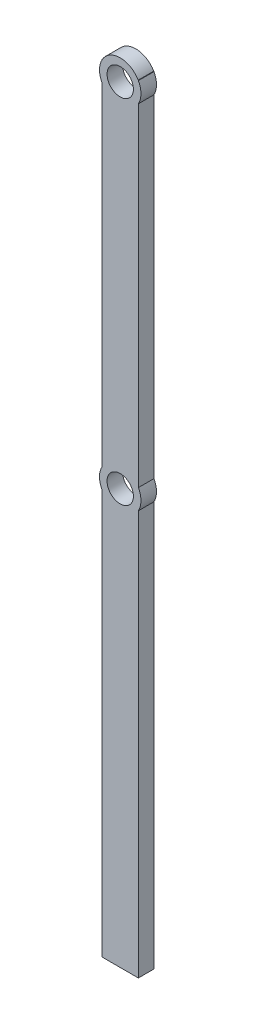
ISO-10303-21;
HEADER;
FILE_DESCRIPTION(('STEP AP214'),'2;1');
FILE_NAME('part.step','',(''),(''),'','','');
FILE_SCHEMA(('AUTOMOTIVE_DESIGN { 1 0 10303 214 1 1 1 1 }'));
ENDSEC;
DATA;
#1=APPLICATION_CONTEXT('core data for automotive mechanical design processes');
#2=APPLICATION_PROTOCOL_DEFINITION('international standard','automotive_design',2000,#1);
#3=PRODUCT_CONTEXT('',#1,'mechanical');
#4=PRODUCT('Part','Part','',(#3));
#5=PRODUCT_RELATED_PRODUCT_CATEGORY('part','',(#4));
#6=PRODUCT_DEFINITION_FORMATION('','',#4);
#7=PRODUCT_DEFINITION_CONTEXT('part definition',#1,'design');
#8=PRODUCT_DEFINITION('design','',#6,#7);
#9=PRODUCT_DEFINITION_SHAPE('','',#8);
#10=(LENGTH_UNIT() NAMED_UNIT(*) SI_UNIT(.MILLI.,.METRE.));
#11=(NAMED_UNIT(*) PLANE_ANGLE_UNIT() SI_UNIT($,.RADIAN.));
#12=(NAMED_UNIT(*) SI_UNIT($,.STERADIAN.) SOLID_ANGLE_UNIT());
#13=UNCERTAINTY_MEASURE_WITH_UNIT(LENGTH_MEASURE(1.E-05),#10,'distance_accuracy_value','');
#14=(GEOMETRIC_REPRESENTATION_CONTEXT(3) GLOBAL_UNCERTAINTY_ASSIGNED_CONTEXT((#13)) GLOBAL_UNIT_ASSIGNED_CONTEXT((#10,
#11,#12)) REPRESENTATION_CONTEXT('',''));
#15=CARTESIAN_POINT('',(0.,0.,0.));
#16=DIRECTION('',(0.,0.,1.));
#17=DIRECTION('',(1.,0.,0.));
#18=AXIS2_PLACEMENT_3D('',#15,#16,#17);
#19=CARTESIAN_POINT('',(17.5,350.,-7.5));
#20=DIRECTION('',(-1.,0.,0.));
#21=DIRECTION('',(0.,0.,1.));
#22=AXIS2_PLACEMENT_3D('',#19,#20,#21);
#23=PLANE('',#22);
#24=DIRECTION('',(0.,0.,-1.));
#25=VECTOR('',#24,1.);
#26=CARTESIAN_POINT('',(17.5,349.682458365519,7.49999999999999));
#27=LINE('',#26,#25);
#28=CARTESIAN_POINT('',(17.5,349.682458365519,-7.5));
#29=VERTEX_POINT('',#28);
#30=CARTESIAN_POINT('',(17.5,349.682458365519,7.5));
#31=VERTEX_POINT('',#30);
#32=EDGE_CURVE('E61',#29,#31,#27,.F.);
#33=ORIENTED_EDGE('',*,*,#32,.F.);
#34=DIRECTION('',(0.,-1.,0.));
#35=VECTOR('',#34,1.);
#36=CARTESIAN_POINT('',(17.5,350.,-7.5));
#37=LINE('',#36,#35);
#38=CARTESIAN_POINT('',(17.5,350.,-7.5));
#39=VERTEX_POINT('',#38);
#40=EDGE_CURVE('E226',#39,#29,#37,.T.);
#41=ORIENTED_EDGE('',*,*,#40,.F.);
#42=DIRECTION('',(0.,0.,-1.));
#43=VECTOR('',#42,1.);
#44=CARTESIAN_POINT('',(17.5,350.,-7.5));
#45=LINE('',#44,#43);
#46=CARTESIAN_POINT('',(17.5,350.,7.5));
#47=VERTEX_POINT('',#46);
#48=EDGE_CURVE('E204',#47,#39,#45,.T.);
#49=ORIENTED_EDGE('',*,*,#48,.F.);
#50=DIRECTION('',(0.,-1.,0.));
#51=VECTOR('',#50,1.);
#52=CARTESIAN_POINT('',(17.5,350.,7.5));
#53=LINE('',#52,#51);
#54=EDGE_CURVE('E219',#47,#31,#53,.T.);
#55=ORIENTED_EDGE('',*,*,#54,.T.);
#56=EDGE_LOOP('',(#33,#41,#49,#55));
#57=FACE_BOUND('',#56,.T.);
#58=ADVANCED_FACE('F45',(#57),#23,.F.);
#59=DIRECTION('',(0.,0.,-1.));
#60=VECTOR('',#59,1.);
#61=CARTESIAN_POINT('',(17.5,330.317541634482,7.49999999999999));
#62=LINE('',#61,#60);
#63=CARTESIAN_POINT('',(17.5,330.317541634482,7.5));
#64=VERTEX_POINT('',#63);
#65=CARTESIAN_POINT('',(17.5,330.317541634482,-7.5));
#66=VERTEX_POINT('',#65);
#67=EDGE_CURVE('E69',#64,#66,#62,.T.);
#68=ORIENTED_EDGE('',*,*,#67,.F.);
#69=CARTESIAN_POINT('',(17.5,9.68245836551855,7.5));
#70=VERTEX_POINT('',#69);
#71=EDGE_CURVE('E218',#64,#70,#53,.T.);
#72=ORIENTED_EDGE('',*,*,#71,.T.);
#73=DIRECTION('',(0.,0.,-1.));
#74=VECTOR('',#73,1.);
#75=CARTESIAN_POINT('',(17.5,9.68245836551855,7.49999999999999));
#76=LINE('',#75,#74);
#77=CARTESIAN_POINT('',(17.5,9.68245836551856,-7.5));
#78=VERTEX_POINT('',#77);
#79=EDGE_CURVE('E283',#70,#78,#76,.T.);
#80=ORIENTED_EDGE('',*,*,#79,.T.);
#81=EDGE_CURVE('E158',#66,#78,#37,.T.);
#82=ORIENTED_EDGE('',*,*,#81,.F.);
#83=EDGE_LOOP('',(#68,#72,#80,#82));
#84=FACE_BOUND('',#83,.T.);
#85=ADVANCED_FACE('F317',(#84),#23,.F.);
#86=CARTESIAN_POINT('',(-17.5,350.,-7.5));
#87=DIRECTION('',(1.,0.,0.));
#88=DIRECTION('',(0.,0.,-1.));
#89=AXIS2_PLACEMENT_3D('',#86,#87,#88);
#90=PLANE('',#89);
#91=DIRECTION('',(0.,0.,-1.));
#92=VECTOR('',#91,1.);
#93=CARTESIAN_POINT('',(-17.5,330.317541634482,7.5));
#94=LINE('',#93,#92);
#95=CARTESIAN_POINT('',(-17.5,330.317541634482,-7.5));
#96=VERTEX_POINT('',#95);
#97=CARTESIAN_POINT('',(-17.5,330.317541634482,7.5));
#98=VERTEX_POINT('',#97);
#99=EDGE_CURVE('E170',#96,#98,#94,.F.);
#100=ORIENTED_EDGE('',*,*,#99,.F.);
#101=DIRECTION('',(0.,-1.,0.));
#102=VECTOR('',#101,1.);
#103=CARTESIAN_POINT('',(-17.5,350.,-7.5));
#104=LINE('',#103,#102);
#105=CARTESIAN_POINT('',(-17.5,9.68245836551851,-7.5));
#106=VERTEX_POINT('',#105);
#107=EDGE_CURVE('E159',#96,#106,#104,.T.);
#108=ORIENTED_EDGE('',*,*,#107,.T.);
#109=DIRECTION('',(0.,0.,-1.));
#110=VECTOR('',#109,1.);
#111=CARTESIAN_POINT('',(-17.5,9.68245836551853,7.5));
#112=LINE('',#111,#110);
#113=CARTESIAN_POINT('',(-17.5,9.68245836551853,7.5));
#114=VERTEX_POINT('',#113);
#115=EDGE_CURVE('E279',#106,#114,#112,.F.);
#116=ORIENTED_EDGE('',*,*,#115,.T.);
#117=DIRECTION('',(0.,-1.,0.));
#118=VECTOR('',#117,1.);
#119=CARTESIAN_POINT('',(-17.5,350.,7.5));
#120=LINE('',#119,#118);
#121=EDGE_CURVE('E222',#98,#114,#120,.T.);
#122=ORIENTED_EDGE('',*,*,#121,.F.);
#123=EDGE_LOOP('',(#100,#108,#116,#122));
#124=FACE_BOUND('',#123,.T.);
#125=ADVANCED_FACE('F322',(#124),#90,.F.);
#126=DIRECTION('',(0.,0.,-1.));
#127=VECTOR('',#126,1.);
#128=CARTESIAN_POINT('',(-17.5,349.682458365519,7.5));
#129=LINE('',#128,#127);
#130=CARTESIAN_POINT('',(-17.5,349.682458365519,7.5));
#131=VERTEX_POINT('',#130);
#132=CARTESIAN_POINT('',(-17.5,349.682458365519,-7.5));
#133=VERTEX_POINT('',#132);
#134=EDGE_CURVE('E151',#131,#133,#129,.T.);
#135=ORIENTED_EDGE('',*,*,#134,.F.);
#136=CARTESIAN_POINT('',(-17.5,350.,7.5));
#137=VERTEX_POINT('',#136);
#138=EDGE_CURVE('E223',#137,#131,#120,.T.);
#139=ORIENTED_EDGE('',*,*,#138,.F.);
#140=DIRECTION('',(0.,0.,1.));
#141=VECTOR('',#140,1.);
#142=CARTESIAN_POINT('',(-17.5,350.,-7.5));
#143=LINE('',#142,#141);
#144=CARTESIAN_POINT('',(-17.5,350.,-7.5));
#145=VERTEX_POINT('',#144);
#146=EDGE_CURVE('E153',#145,#137,#143,.T.);
#147=ORIENTED_EDGE('',*,*,#146,.F.);
#148=EDGE_CURVE('E147',#145,#133,#104,.T.);
#149=ORIENTED_EDGE('',*,*,#148,.T.);
#150=EDGE_LOOP('',(#135,#139,#147,#149));
#151=FACE_BOUND('',#150,.T.);
#152=ADVANCED_FACE('F149',(#151),#90,.F.);
#153=CARTESIAN_POINT('',(0.,350.,0.));
#154=DIRECTION('',(0.,1.,0.));
#155=DIRECTION('',(0.,0.,1.));
#156=AXIS2_PLACEMENT_3D('',#153,#154,#155);
#157=PLANE('',#156);
#158=DIRECTION('',(-1.,0.,0.));
#159=VECTOR('',#158,1.);
#160=CARTESIAN_POINT('',(-17.5,350.,-7.5));
#161=LINE('',#160,#159);
#162=CARTESIAN_POINT('',(17.3205080756889,350.,-7.5));
#163=VERTEX_POINT('',#162);
#164=EDGE_CURVE('E209',#39,#163,#161,.T.);
#165=ORIENTED_EDGE('',*,*,#164,.T.);
#166=DIRECTION('',(0.,0.,-1.));
#167=VECTOR('',#166,1.);
#168=CARTESIAN_POINT('',(17.3205080756889,350.,7.5));
#169=LINE('',#168,#167);
#170=CARTESIAN_POINT('',(17.3205080756889,350.,7.5));
#171=VERTEX_POINT('',#170);
#172=EDGE_CURVE('E11',#163,#171,#169,.F.);
#173=ORIENTED_EDGE('',*,*,#172,.T.);
#174=DIRECTION('',(1.,0.,0.));
#175=VECTOR('',#174,1.);
#176=CARTESIAN_POINT('',(-17.5,350.,7.5));
#177=LINE('',#176,#175);
#178=EDGE_CURVE('E214',#171,#47,#177,.T.);
#179=ORIENTED_EDGE('',*,*,#178,.T.);
#180=ORIENTED_EDGE('',*,*,#48,.T.);
#181=EDGE_LOOP('',(#165,#173,#179,#180));
#182=FACE_BOUND('',#181,.T.);
#183=ADVANCED_FACE('F300',(#182),#157,.T.);
#184=CARTESIAN_POINT('',(-17.3205080756889,350.,7.5));
#185=VERTEX_POINT('',#184);
#186=EDGE_CURVE('E215',#137,#185,#177,.T.);
#187=ORIENTED_EDGE('',*,*,#186,.T.);
#188=DIRECTION('',(0.,0.,-1.));
#189=VECTOR('',#188,1.);
#190=CARTESIAN_POINT('',(-17.3205080756889,350.,7.5));
#191=LINE('',#190,#189);
#192=CARTESIAN_POINT('',(-17.3205080756889,350.,-7.5));
#193=VERTEX_POINT('',#192);
#194=EDGE_CURVE('E54',#185,#193,#191,.T.);
#195=ORIENTED_EDGE('',*,*,#194,.T.);
#196=EDGE_CURVE('E208',#193,#145,#161,.T.);
#197=ORIENTED_EDGE('',*,*,#196,.T.);
#198=ORIENTED_EDGE('',*,*,#146,.T.);
#199=EDGE_LOOP('',(#187,#195,#197,#198));
#200=FACE_BOUND('',#199,.T.);
#201=ADVANCED_FACE('F289',(#200),#157,.T.);
#202=CARTESIAN_POINT('',(0.,0.,7.5));
#203=DIRECTION('',(0.,0.,-1.));
#204=DIRECTION('',(-1.,0.,0.));
#205=AXIS2_PLACEMENT_3D('',#202,#203,#204);
#206=CYLINDRICAL_SURFACE('',#205,20.);
#207=ORIENTED_EDGE('',*,*,#79,.F.);
#208=CARTESIAN_POINT('',(0.,0.,7.5));
#209=DIRECTION('',(0.,0.,1.));
#210=DIRECTION('',(1.,0.,0.));
#211=AXIS2_PLACEMENT_3D('',#208,#209,#210);
#212=CIRCLE('',#211,20.);
#213=CARTESIAN_POINT('',(17.5,-9.68245836551855,7.5));
#214=VERTEX_POINT('',#213);
#215=EDGE_CURVE('E262',#214,#70,#212,.T.);
#216=ORIENTED_EDGE('',*,*,#215,.F.);
#217=DIRECTION('',(0.,0.,-1.));
#218=VECTOR('',#217,1.);
#219=CARTESIAN_POINT('',(17.5,-9.68245836551855,7.49999999999999));
#220=LINE('',#219,#218);
#221=CARTESIAN_POINT('',(17.5,-9.68245836551856,-7.5));
#222=VERTEX_POINT('',#221);
#223=EDGE_CURVE('E275',#214,#222,#220,.T.);
#224=ORIENTED_EDGE('',*,*,#223,.T.);
#225=CARTESIAN_POINT('',(0.,0.,-7.5));
#226=DIRECTION('',(0.,0.,1.));
#227=DIRECTION('',(1.,0.,0.));
#228=AXIS2_PLACEMENT_3D('',#225,#226,#227);
#229=CIRCLE('',#228,20.);
#230=EDGE_CURVE('E268',#222,#78,#229,.T.);
#231=ORIENTED_EDGE('',*,*,#230,.T.);
#232=EDGE_LOOP('',(#207,#216,#224,#231));
#233=FACE_BOUND('',#232,.T.);
#234=ADVANCED_FACE('F47',(#233),#206,.T.);
#235=ORIENTED_EDGE('',*,*,#115,.F.);
#236=CARTESIAN_POINT('',(-17.5,-9.68245836551852,-7.5));
#237=VERTEX_POINT('',#236);
#238=EDGE_CURVE('E250',#106,#237,#229,.T.);
#239=ORIENTED_EDGE('',*,*,#238,.T.);
#240=DIRECTION('',(0.,0.,-1.));
#241=VECTOR('',#240,1.);
#242=CARTESIAN_POINT('',(-17.5,-9.68245836551853,7.5));
#243=LINE('',#242,#241);
#244=CARTESIAN_POINT('',(-17.5,-9.68245836551853,7.5));
#245=VERTEX_POINT('',#244);
#246=EDGE_CURVE('E266',#237,#245,#243,.F.);
#247=ORIENTED_EDGE('',*,*,#246,.T.);
#248=EDGE_CURVE('E267',#114,#245,#212,.T.);
#249=ORIENTED_EDGE('',*,*,#248,.F.);
#250=EDGE_LOOP('',(#235,#239,#247,#249));
#251=FACE_BOUND('',#250,.T.);
#252=ADVANCED_FACE('F340',(#251),#206,.T.);
#253=CARTESIAN_POINT('',(0.,0.,7.5));
#254=DIRECTION('',(0.,0.,1.));
#255=DIRECTION('',(1.,0.,0.));
#256=AXIS2_PLACEMENT_3D('',#253,#254,#255);
#257=PLANE('',#256);
#258=CARTESIAN_POINT('',(0.,340.,7.5));
#259=DIRECTION('',(0.,0.,1.));
#260=DIRECTION('',(1.,0.,0.));
#261=AXIS2_PLACEMENT_3D('',#258,#259,#260);
#262=CIRCLE('',#261,12.7);
#263=CARTESIAN_POINT('',(12.7,340.,7.5));
#264=VERTEX_POINT('',#263);
#265=EDGE_CURVE('E186',#264,#264,#262,.T.);
#266=ORIENTED_EDGE('',*,*,#265,.F.);
#267=EDGE_LOOP('',(#266));
#268=FACE_BOUND('',#267,.T.);
#269=ORIENTED_EDGE('',*,*,#178,.F.);
#270=CARTESIAN_POINT('',(0.,340.,7.5));
#271=DIRECTION('',(0.,0.,1.));
#272=DIRECTION('',(1.,0.,0.));
#273=AXIS2_PLACEMENT_3D('',#270,#271,#272);
#274=CIRCLE('',#273,20.);
#275=EDGE_CURVE('E171',#171,#185,#274,.T.);
#276=ORIENTED_EDGE('',*,*,#275,.T.);
#277=ORIENTED_EDGE('',*,*,#186,.F.);
#278=ORIENTED_EDGE('',*,*,#138,.T.);
#279=EDGE_CURVE('E168',#131,#98,#274,.T.);
#280=ORIENTED_EDGE('',*,*,#279,.T.);
#281=ORIENTED_EDGE('',*,*,#121,.T.);
#282=ORIENTED_EDGE('',*,*,#248,.T.);
#283=DIRECTION('',(0.,1.,0.));
#284=VECTOR('',#283,1.);
#285=CARTESIAN_POINT('',(-17.5,-400.,7.5));
#286=LINE('',#285,#284);
#287=CARTESIAN_POINT('',(-17.5,-400.,7.5));
#288=VERTEX_POINT('',#287);
#289=EDGE_CURVE('E251',#288,#245,#286,.T.);
#290=ORIENTED_EDGE('',*,*,#289,.F.);
#291=DIRECTION('',(1.,0.,0.));
#292=VECTOR('',#291,1.);
#293=CARTESIAN_POINT('',(-17.5,-400.,7.5));
#294=LINE('',#293,#292);
#295=CARTESIAN_POINT('',(17.5,-400.,7.5));
#296=VERTEX_POINT('',#295);
#297=EDGE_CURVE('E241',#288,#296,#294,.T.);
#298=ORIENTED_EDGE('',*,*,#297,.T.);
#299=DIRECTION('',(0.,1.,0.));
#300=VECTOR('',#299,1.);
#301=CARTESIAN_POINT('',(17.5,-400.,7.5));
#302=LINE('',#301,#300);
#303=EDGE_CURVE('E246',#296,#214,#302,.T.);
#304=ORIENTED_EDGE('',*,*,#303,.T.);
#305=ORIENTED_EDGE('',*,*,#215,.T.);
#306=ORIENTED_EDGE('',*,*,#71,.F.);
#307=EDGE_CURVE('E184',#64,#31,#274,.T.);
#308=ORIENTED_EDGE('',*,*,#307,.T.);
#309=ORIENTED_EDGE('',*,*,#54,.F.);
#310=EDGE_LOOP('',(#269,#276,#277,#278,#280,#281,#282,#290,#298,#304,#305,#306,#308,#309));
#311=FACE_BOUND('',#310,.T.);
#312=CARTESIAN_POINT('',(0.,0.,7.5));
#313=DIRECTION('',(0.,0.,1.));
#314=DIRECTION('',(1.,0.,0.));
#315=AXIS2_PLACEMENT_3D('',#312,#313,#314);
#316=CIRCLE('',#315,12.7);
#317=CARTESIAN_POINT('',(12.7,0.,7.5));
#318=VERTEX_POINT('',#317);
#319=EDGE_CURVE('E196',#318,#318,#316,.T.);
#320=ORIENTED_EDGE('',*,*,#319,.F.);
#321=EDGE_LOOP('',(#320));
#322=FACE_BOUND('',#321,.T.);
#323=ADVANCED_FACE('F303',(#268,#311,#322),#257,.T.);
#324=CARTESIAN_POINT('',(0.,0.,-7.5));
#325=DIRECTION('',(0.,0.,1.));
#326=DIRECTION('',(1.,0.,0.));
#327=AXIS2_PLACEMENT_3D('',#324,#325,#326);
#328=PLANE('',#327);
#329=ORIENTED_EDGE('',*,*,#40,.T.);
#330=CARTESIAN_POINT('',(0.,340.,-7.5));
#331=DIRECTION('',(0.,0.,1.));
#332=DIRECTION('',(1.,0.,0.));
#333=AXIS2_PLACEMENT_3D('',#330,#331,#332);
#334=CIRCLE('',#333,20.);
#335=EDGE_CURVE('E179',#66,#29,#334,.T.);
#336=ORIENTED_EDGE('',*,*,#335,.F.);
#337=ORIENTED_EDGE('',*,*,#81,.T.);
#338=ORIENTED_EDGE('',*,*,#230,.F.);
#339=DIRECTION('',(0.,1.,0.));
#340=VECTOR('',#339,1.);
#341=CARTESIAN_POINT('',(17.5,-400.,-7.5));
#342=LINE('',#341,#340);
#343=CARTESIAN_POINT('',(17.5,-400.,-7.5));
#344=VERTEX_POINT('',#343);
#345=EDGE_CURVE('E245',#344,#222,#342,.T.);
#346=ORIENTED_EDGE('',*,*,#345,.F.);
#347=DIRECTION('',(-1.,0.,0.));
#348=VECTOR('',#347,1.);
#349=CARTESIAN_POINT('',(-17.5,-400.,-7.5));
#350=LINE('',#349,#348);
#351=CARTESIAN_POINT('',(-17.5,-400.,-7.5));
#352=VERTEX_POINT('',#351);
#353=EDGE_CURVE('E233',#344,#352,#350,.T.);
#354=ORIENTED_EDGE('',*,*,#353,.T.);
#355=DIRECTION('',(0.,1.,0.));
#356=VECTOR('',#355,1.);
#357=CARTESIAN_POINT('',(-17.5,-400.,-7.5));
#358=LINE('',#357,#356);
#359=EDGE_CURVE('E255',#352,#237,#358,.T.);
#360=ORIENTED_EDGE('',*,*,#359,.T.);
#361=ORIENTED_EDGE('',*,*,#238,.F.);
#362=ORIENTED_EDGE('',*,*,#107,.F.);
#363=EDGE_CURVE('E166',#133,#96,#334,.T.);
#364=ORIENTED_EDGE('',*,*,#363,.F.);
#365=ORIENTED_EDGE('',*,*,#148,.F.);
#366=ORIENTED_EDGE('',*,*,#196,.F.);
#367=EDGE_CURVE('E178',#163,#193,#334,.T.);
#368=ORIENTED_EDGE('',*,*,#367,.F.);
#369=ORIENTED_EDGE('',*,*,#164,.F.);
#370=EDGE_LOOP('',(#329,#336,#337,#338,#346,#354,#360,#361,#362,#364,#365,#366,#368,#369));
#371=FACE_BOUND('',#370,.T.);
#372=CARTESIAN_POINT('',(0.,340.,-7.5));
#373=DIRECTION('',(0.,0.,1.));
#374=DIRECTION('',(1.,0.,0.));
#375=AXIS2_PLACEMENT_3D('',#372,#373,#374);
#376=CIRCLE('',#375,12.7);
#377=CARTESIAN_POINT('',(12.7,340.,-7.5));
#378=VERTEX_POINT('',#377);
#379=EDGE_CURVE('E579',#378,#378,#376,.T.);
#380=ORIENTED_EDGE('',*,*,#379,.T.);
#381=EDGE_LOOP('',(#380));
#382=FACE_BOUND('',#381,.T.);
#383=CARTESIAN_POINT('',(0.,0.,-7.5));
#384=DIRECTION('',(0.,0.,1.));
#385=DIRECTION('',(1.,0.,0.));
#386=AXIS2_PLACEMENT_3D('',#383,#384,#385);
#387=CIRCLE('',#386,12.7);
#388=CARTESIAN_POINT('',(12.7,0.,-7.5));
#389=VERTEX_POINT('',#388);
#390=EDGE_CURVE('E200',#389,#389,#387,.T.);
#391=ORIENTED_EDGE('',*,*,#390,.T.);
#392=EDGE_LOOP('',(#391));
#393=FACE_BOUND('',#392,.T.);
#394=ADVANCED_FACE('F174',(#371,#382,#393),#328,.F.);
#395=CARTESIAN_POINT('',(17.5,-400.,-7.5));
#396=DIRECTION('',(1.,0.,0.));
#397=DIRECTION('',(0.,0.,-1.));
#398=AXIS2_PLACEMENT_3D('',#395,#396,#397);
#399=PLANE('',#398);
#400=ORIENTED_EDGE('',*,*,#223,.F.);
#401=ORIENTED_EDGE('',*,*,#303,.F.);
#402=DIRECTION('',(0.,0.,-1.));
#403=VECTOR('',#402,1.);
#404=CARTESIAN_POINT('',(17.5,-400.,-7.5));
#405=LINE('',#404,#403);
#406=EDGE_CURVE('E229',#296,#344,#405,.T.);
#407=ORIENTED_EDGE('',*,*,#406,.T.);
#408=ORIENTED_EDGE('',*,*,#345,.T.);
#409=EDGE_LOOP('',(#400,#401,#407,#408));
#410=FACE_BOUND('',#409,.T.);
#411=ADVANCED_FACE('F334',(#410),#399,.T.);
#412=CARTESIAN_POINT('',(-17.5,-400.,-7.5));
#413=DIRECTION('',(-1.,0.,0.));
#414=DIRECTION('',(0.,0.,1.));
#415=AXIS2_PLACEMENT_3D('',#412,#413,#414);
#416=PLANE('',#415);
#417=ORIENTED_EDGE('',*,*,#246,.F.);
#418=ORIENTED_EDGE('',*,*,#359,.F.);
#419=DIRECTION('',(0.,0.,1.));
#420=VECTOR('',#419,1.);
#421=CARTESIAN_POINT('',(-17.5,-400.,-7.5));
#422=LINE('',#421,#420);
#423=EDGE_CURVE('E237',#352,#288,#422,.T.);
#424=ORIENTED_EDGE('',*,*,#423,.T.);
#425=ORIENTED_EDGE('',*,*,#289,.T.);
#426=EDGE_LOOP('',(#417,#418,#424,#425));
#427=FACE_BOUND('',#426,.T.);
#428=ADVANCED_FACE('F330',(#427),#416,.T.);
#429=CARTESIAN_POINT('',(0.,-400.,0.));
#430=DIRECTION('',(0.,1.,0.));
#431=DIRECTION('',(0.,0.,1.));
#432=AXIS2_PLACEMENT_3D('',#429,#430,#431);
#433=PLANE('',#432);
#434=ORIENTED_EDGE('',*,*,#406,.F.);
#435=ORIENTED_EDGE('',*,*,#297,.F.);
#436=ORIENTED_EDGE('',*,*,#423,.F.);
#437=ORIENTED_EDGE('',*,*,#353,.F.);
#438=EDGE_LOOP('',(#434,#435,#436,#437));
#439=FACE_BOUND('',#438,.T.);
#440=ADVANCED_FACE('F326',(#439),#433,.F.);
#441=CARTESIAN_POINT('',(0.,0.,-7.5));
#442=DIRECTION('',(0.,0.,1.));
#443=DIRECTION('',(1.,0.,0.));
#444=AXIS2_PLACEMENT_3D('',#441,#442,#443);
#445=CYLINDRICAL_SURFACE('',#444,12.7);
#446=ORIENTED_EDGE('',*,*,#390,.F.);
#447=EDGE_LOOP('',(#446));
#448=FACE_BOUND('',#447,.T.);
#449=ORIENTED_EDGE('',*,*,#319,.T.);
#450=EDGE_LOOP('',(#449));
#451=FACE_BOUND('',#450,.T.);
#452=ADVANCED_FACE('F329',(#448,#451),#445,.F.);
#453=CARTESIAN_POINT('',(0.,340.,7.5));
#454=DIRECTION('',(0.,0.,-1.));
#455=DIRECTION('',(-1.,0.,0.));
#456=AXIS2_PLACEMENT_3D('',#453,#454,#455);
#457=CYLINDRICAL_SURFACE('',#456,12.7);
#458=ORIENTED_EDGE('',*,*,#379,.F.);
#459=EDGE_LOOP('',(#458));
#460=FACE_BOUND('',#459,.T.);
#461=ORIENTED_EDGE('',*,*,#265,.T.);
#462=EDGE_LOOP('',(#461));
#463=FACE_BOUND('',#462,.T.);
#464=ADVANCED_FACE('F366',(#460,#463),#457,.F.);
#465=CARTESIAN_POINT('',(0.,340.,7.5));
#466=DIRECTION('',(0.,0.,-1.));
#467=DIRECTION('',(-1.,0.,0.));
#468=AXIS2_PLACEMENT_3D('',#465,#466,#467);
#469=CYLINDRICAL_SURFACE('',#468,20.);
#470=ORIENTED_EDGE('',*,*,#172,.F.);
#471=ORIENTED_EDGE('',*,*,#367,.T.);
#472=ORIENTED_EDGE('',*,*,#194,.F.);
#473=ORIENTED_EDGE('',*,*,#275,.F.);
#474=EDGE_LOOP('',(#470,#471,#472,#473));
#475=FACE_BOUND('',#474,.T.);
#476=ADVANCED_FACE('F297',(#475),#469,.T.);
#477=ORIENTED_EDGE('',*,*,#363,.T.);
#478=ORIENTED_EDGE('',*,*,#99,.T.);
#479=ORIENTED_EDGE('',*,*,#279,.F.);
#480=ORIENTED_EDGE('',*,*,#134,.T.);
#481=EDGE_LOOP('',(#477,#478,#479,#480));
#482=FACE_BOUND('',#481,.T.);
#483=ADVANCED_FACE('F164',(#482),#469,.T.);
#484=ORIENTED_EDGE('',*,*,#335,.T.);
#485=ORIENTED_EDGE('',*,*,#32,.T.);
#486=ORIENTED_EDGE('',*,*,#307,.F.);
#487=ORIENTED_EDGE('',*,*,#67,.T.);
#488=EDGE_LOOP('',(#484,#485,#486,#487));
#489=FACE_BOUND('',#488,.T.);
#490=ADVANCED_FACE('F314',(#489),#469,.T.);
#491=CLOSED_SHELL('',(#58,#85,#125,#152,#183,#201,#234,#252,#323,#394,#411,#428,#440,#452,#464,
#476,#483,#490));
#492=MANIFOLD_SOLID_BREP('B2',#491);
#493=ADVANCED_BREP_SHAPE_REPRESENTATION('',(#18,#492),#14);
#494=SHAPE_DEFINITION_REPRESENTATION(#9,#493);
ENDSEC;
END-ISO-10303-21;
